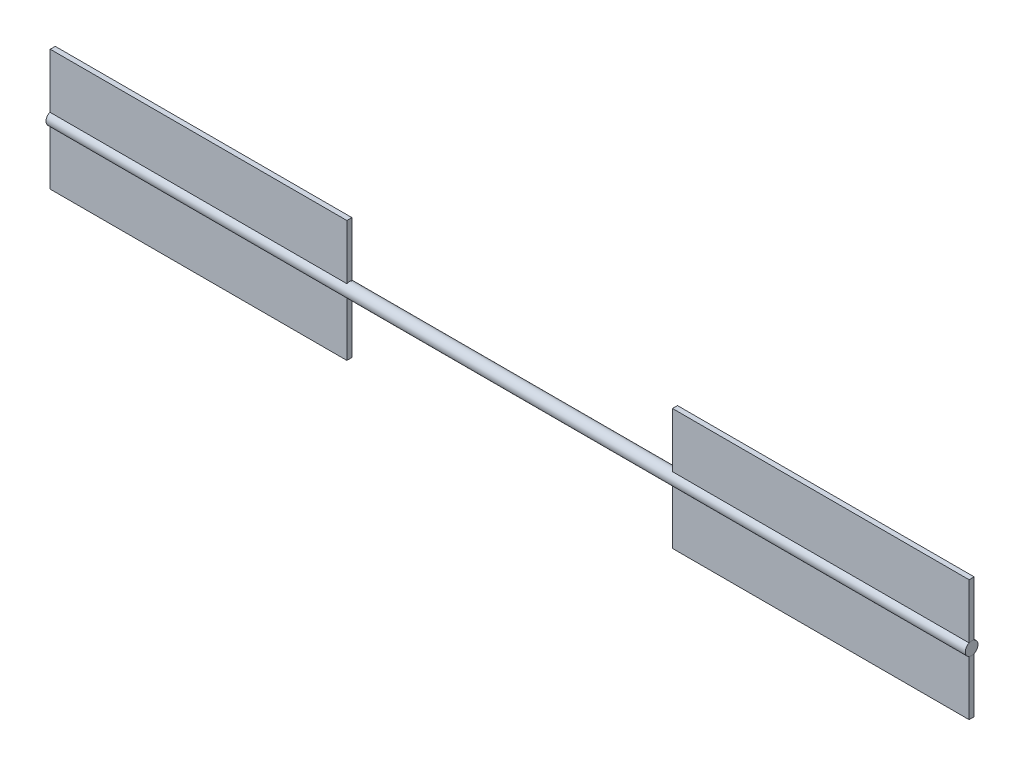
ISO-10303-21;
HEADER;
FILE_DESCRIPTION(('STEP AP214'),'2;1');
FILE_NAME('part.step','',(''),(''),'','','');
FILE_SCHEMA(('AUTOMOTIVE_DESIGN { 1 0 10303 214 1 1 1 1 }'));
ENDSEC;
DATA;
#1=APPLICATION_CONTEXT('core data for automotive mechanical design processes');
#2=APPLICATION_PROTOCOL_DEFINITION('international standard','automotive_design',2000,#1);
#3=PRODUCT_CONTEXT('',#1,'mechanical');
#4=PRODUCT('Part','Part','',(#3));
#5=PRODUCT_RELATED_PRODUCT_CATEGORY('part','',(#4));
#6=PRODUCT_DEFINITION_FORMATION('','',#4);
#7=PRODUCT_DEFINITION_CONTEXT('part definition',#1,'design');
#8=PRODUCT_DEFINITION('design','',#6,#7);
#9=PRODUCT_DEFINITION_SHAPE('','',#8);
#10=(LENGTH_UNIT() NAMED_UNIT(*) SI_UNIT(.MILLI.,.METRE.));
#11=(NAMED_UNIT(*) PLANE_ANGLE_UNIT() SI_UNIT($,.RADIAN.));
#12=(NAMED_UNIT(*) SI_UNIT($,.STERADIAN.) SOLID_ANGLE_UNIT());
#13=UNCERTAINTY_MEASURE_WITH_UNIT(LENGTH_MEASURE(1.E-05),#10,'distance_accuracy_value','');
#14=(GEOMETRIC_REPRESENTATION_CONTEXT(3) GLOBAL_UNCERTAINTY_ASSIGNED_CONTEXT((#13)) GLOBAL_UNIT_ASSIGNED_CONTEXT((#10,
#11,#12)) REPRESENTATION_CONTEXT('',''));
#15=CARTESIAN_POINT('',(0.,0.,0.));
#16=DIRECTION('',(0.,0.,1.));
#17=DIRECTION('',(1.,0.,0.));
#18=AXIS2_PLACEMENT_3D('',#15,#16,#17);
#19=CARTESIAN_POINT('',(-1200.47028357876,0.,197.80000000001));
#20=DIRECTION('',(1.,0.,0.));
#21=DIRECTION('',(0.,0.,-1.));
#22=AXIS2_PLACEMENT_3D('',#19,#20,#21);
#23=CYLINDRICAL_SURFACE('',#22,25.4);
#24=DIRECTION('',(1.,0.,0.));
#25=VECTOR('',#24,1.);
#26=CARTESIAN_POINT('',(-1200.47028357876,-23.3486616318795,207.80000000001));
#27=LINE('',#26,#25);
#28=CARTESIAN_POINT('',(2459.4620213761,-23.3486616318794,207.80000000001));
#29=VERTEX_POINT('',#28);
#30=CARTESIAN_POINT('',(1278.3620213761,-23.3486616318795,207.80000000001));
#31=VERTEX_POINT('',#30);
#32=EDGE_CURVE('E11',#29,#31,#27,.F.);
#33=ORIENTED_EDGE('',*,*,#32,.F.);
#34=CARTESIAN_POINT('',(2459.4620213761,0.,197.80000000001));
#35=DIRECTION('',(1.,0.,0.));
#36=DIRECTION('',(0.,0.,-1.));
#37=AXIS2_PLACEMENT_3D('',#34,#35,#36);
#38=CIRCLE('',#37,25.4);
#39=CARTESIAN_POINT('',(2459.4620213761,-23.3486616318793,187.80000000001));
#40=VERTEX_POINT('',#39);
#41=EDGE_CURVE('E264',#40,#29,#38,.F.);
#42=ORIENTED_EDGE('',*,*,#41,.F.);
#43=DIRECTION('',(1.,0.,0.));
#44=VECTOR('',#43,1.);
#45=CARTESIAN_POINT('',(-1200.47028357876,-23.3486616318794,187.80000000001));
#46=LINE('',#45,#44);
#47=CARTESIAN_POINT('',(1278.3620213761,-23.3486616318794,187.80000000001));
#48=VERTEX_POINT('',#47);
#49=EDGE_CURVE('E267',#40,#48,#46,.F.);
#50=ORIENTED_EDGE('',*,*,#49,.T.);
#51=CARTESIAN_POINT('',(1278.3620213761,0.,197.80000000001));
#52=DIRECTION('',(-1.,0.,0.));
#53=DIRECTION('',(0.,-1.,0.));
#54=AXIS2_PLACEMENT_3D('',#51,#52,#53);
#55=CIRCLE('',#54,25.4);
#56=EDGE_CURVE('E52',#31,#48,#55,.F.);
#57=ORIENTED_EDGE('',*,*,#56,.F.);
#58=EDGE_LOOP('',(#33,#42,#50,#57));
#59=FACE_BOUND('',#58,.T.);
#60=DIRECTION('',(1.,0.,0.));
#61=VECTOR('',#60,1.);
#62=CARTESIAN_POINT('',(-1200.47028357876,23.3486616318794,207.80000000001));
#63=LINE('',#62,#61);
#64=CARTESIAN_POINT('',(1278.3620213761,23.3486616318794,207.80000000001));
#65=VERTEX_POINT('',#64);
#66=CARTESIAN_POINT('',(2459.4620213761,23.3486616318795,207.80000000001));
#67=VERTEX_POINT('',#66);
#68=EDGE_CURVE('E266',#65,#67,#63,.T.);
#69=ORIENTED_EDGE('',*,*,#68,.F.);
#70=CARTESIAN_POINT('',(1278.3620213761,23.3486616318795,187.80000000001));
#71=VERTEX_POINT('',#70);
#72=EDGE_CURVE('E263',#71,#65,#55,.F.);
#73=ORIENTED_EDGE('',*,*,#72,.F.);
#74=DIRECTION('',(1.,0.,0.));
#75=VECTOR('',#74,1.);
#76=CARTESIAN_POINT('',(-1200.47028357876,23.3486616318795,187.80000000001));
#77=LINE('',#76,#75);
#78=CARTESIAN_POINT('',(2459.4620213761,23.3486616318795,187.80000000001));
#79=VERTEX_POINT('',#78);
#80=EDGE_CURVE('E162',#71,#79,#77,.T.);
#81=ORIENTED_EDGE('',*,*,#80,.T.);
#82=EDGE_CURVE('E261',#67,#79,#38,.F.);
#83=ORIENTED_EDGE('',*,*,#82,.F.);
#84=EDGE_LOOP('',(#69,#73,#81,#83));
#85=FACE_BOUND('',#84,.T.);
#86=DIRECTION('',(1.,0.,0.));
#87=VECTOR('',#86,1.);
#88=CARTESIAN_POINT('',(-1200.47028357876,-23.3486616318795,207.80000000001));
#89=LINE('',#88,#87);
#90=CARTESIAN_POINT('',(-17.8955129710086,-23.3486616318795,207.80000000001));
#91=VERTEX_POINT('',#90);
#92=CARTESIAN_POINT('',(-1198.99551297101,-23.3486616318795,207.80000000001));
#93=VERTEX_POINT('',#92);
#94=EDGE_CURVE('E258',#91,#93,#89,.F.);
#95=ORIENTED_EDGE('',*,*,#94,.F.);
#96=CARTESIAN_POINT('',(-17.8955129710088,0.,197.80000000001));
#97=DIRECTION('',(1.,0.,0.));
#98=DIRECTION('',(0.,1.,0.));
#99=AXIS2_PLACEMENT_3D('',#96,#97,#98);
#100=CIRCLE('',#99,25.4);
#101=CARTESIAN_POINT('',(-17.8955129710086,-23.3486616318794,187.80000000001));
#102=VERTEX_POINT('',#101);
#103=EDGE_CURVE('E253',#102,#91,#100,.F.);
#104=ORIENTED_EDGE('',*,*,#103,.F.);
#105=DIRECTION('',(1.,0.,0.));
#106=VECTOR('',#105,1.);
#107=CARTESIAN_POINT('',(-1200.47028357876,-23.3486616318794,187.80000000001));
#108=LINE('',#107,#106);
#109=CARTESIAN_POINT('',(-1198.99551297101,-23.3486616318794,187.80000000001));
#110=VERTEX_POINT('',#109);
#111=EDGE_CURVE('E255',#102,#110,#108,.F.);
#112=ORIENTED_EDGE('',*,*,#111,.T.);
#113=CARTESIAN_POINT('',(-1198.99551297101,0.,197.80000000001));
#114=DIRECTION('',(-1.,0.,0.));
#115=DIRECTION('',(0.,0.,1.));
#116=AXIS2_PLACEMENT_3D('',#113,#114,#115);
#117=CIRCLE('',#116,25.4);
#118=EDGE_CURVE('E249',#93,#110,#117,.F.);
#119=ORIENTED_EDGE('',*,*,#118,.F.);
#120=EDGE_LOOP('',(#95,#104,#112,#119));
#121=FACE_BOUND('',#120,.T.);
#122=DIRECTION('',(1.,0.,0.));
#123=VECTOR('',#122,1.);
#124=CARTESIAN_POINT('',(-1200.47028357876,23.3486616318794,207.80000000001));
#125=LINE('',#124,#123);
#126=CARTESIAN_POINT('',(-1198.99551297101,23.3486616318794,207.80000000001));
#127=VERTEX_POINT('',#126);
#128=CARTESIAN_POINT('',(-17.8955129710086,23.3486616318794,207.80000000001));
#129=VERTEX_POINT('',#128);
#130=EDGE_CURVE('E252',#127,#129,#125,.T.);
#131=ORIENTED_EDGE('',*,*,#130,.F.);
#132=CARTESIAN_POINT('',(-1198.99551297101,23.3486616318795,187.80000000001));
#133=VERTEX_POINT('',#132);
#134=EDGE_CURVE('E246',#133,#127,#117,.F.);
#135=ORIENTED_EDGE('',*,*,#134,.F.);
#136=DIRECTION('',(1.,0.,0.));
#137=VECTOR('',#136,1.);
#138=CARTESIAN_POINT('',(-1200.47028357876,23.3486616318795,187.80000000001));
#139=LINE('',#138,#137);
#140=CARTESIAN_POINT('',(-17.8955129710086,23.3486616318795,187.80000000001));
#141=VERTEX_POINT('',#140);
#142=EDGE_CURVE('E241',#133,#141,#139,.T.);
#143=ORIENTED_EDGE('',*,*,#142,.T.);
#144=EDGE_CURVE('E248',#129,#141,#100,.F.);
#145=ORIENTED_EDGE('',*,*,#144,.F.);
#146=EDGE_LOOP('',(#131,#135,#143,#145));
#147=FACE_BOUND('',#146,.T.);
#148=CARTESIAN_POINT('',(-1200.47028357876,0.,197.80000000001));
#149=DIRECTION('',(1.,0.,0.));
#150=DIRECTION('',(0.,0.,-1.));
#151=AXIS2_PLACEMENT_3D('',#148,#149,#150);
#152=CIRCLE('',#151,25.4);
#153=CARTESIAN_POINT('',(-1200.47028357876,0.,172.40000000001));
#154=VERTEX_POINT('',#153);
#155=EDGE_CURVE('E238',#154,#154,#152,.T.);
#156=ORIENTED_EDGE('',*,*,#155,.T.);
#157=EDGE_LOOP('',(#156));
#158=FACE_BOUND('',#157,.T.);
#159=CARTESIAN_POINT('',(2459.52971642124,0.,197.80000000001));
#160=DIRECTION('',(1.,0.,0.));
#161=DIRECTION('',(0.,0.,-1.));
#162=AXIS2_PLACEMENT_3D('',#159,#160,#161);
#163=CIRCLE('',#162,25.4);
#164=CARTESIAN_POINT('',(2459.52971642124,0.,172.40000000001));
#165=VERTEX_POINT('',#164);
#166=EDGE_CURVE('E198',#165,#165,#163,.T.);
#167=ORIENTED_EDGE('',*,*,#166,.F.);
#168=EDGE_LOOP('',(#167));
#169=FACE_BOUND('',#168,.T.);
#170=ADVANCED_FACE('F45',(#59,#85,#121,#147,#158,#169),#23,.T.);
#171=CARTESIAN_POINT('',(-1200.47028357876,0.,197.80000000001));
#172=DIRECTION('',(1.,0.,0.));
#173=DIRECTION('',(0.,0.,-1.));
#174=AXIS2_PLACEMENT_3D('',#171,#172,#173);
#175=PLANE('',#174);
#176=ORIENTED_EDGE('',*,*,#155,.F.);
#177=EDGE_LOOP('',(#176));
#178=FACE_BOUND('',#177,.T.);
#179=ADVANCED_FACE('F300',(#178),#175,.F.);
#180=CARTESIAN_POINT('',(2459.52971642124,0.,197.80000000001));
#181=DIRECTION('',(1.,0.,0.));
#182=DIRECTION('',(0.,0.,-1.));
#183=AXIS2_PLACEMENT_3D('',#180,#181,#182);
#184=PLANE('',#183);
#185=ORIENTED_EDGE('',*,*,#166,.T.);
#186=EDGE_LOOP('',(#185));
#187=FACE_BOUND('',#186,.T.);
#188=ADVANCED_FACE('F304',(#187),#184,.T.);
#189=CARTESIAN_POINT('',(-17.8955129710086,241.299999999999,207.800000000011));
#190=DIRECTION('',(0.,1.,0.));
#191=DIRECTION('',(0.,0.,1.));
#192=AXIS2_PLACEMENT_3D('',#189,#190,#191);
#193=PLANE('',#192);
#194=DIRECTION('',(0.,0.,-1.));
#195=VECTOR('',#194,1.);
#196=CARTESIAN_POINT('',(-17.8955129710086,241.299999999999,207.800000000011));
#197=LINE('',#196,#195);
#198=CARTESIAN_POINT('',(-17.8955129710086,241.299999999999,207.800000000011));
#199=VERTEX_POINT('',#198);
#200=CARTESIAN_POINT('',(-17.8955129710086,241.299999999999,187.800000000011));
#201=VERTEX_POINT('',#200);
#202=EDGE_CURVE('E212',#199,#201,#197,.T.);
#203=ORIENTED_EDGE('',*,*,#202,.T.);
#204=DIRECTION('',(1.,0.,0.));
#205=VECTOR('',#204,1.);
#206=CARTESIAN_POINT('',(-17.8955129710086,241.299999999999,187.800000000011));
#207=LINE('',#206,#205);
#208=CARTESIAN_POINT('',(-1198.99551297101,241.299999999999,187.800000000011));
#209=VERTEX_POINT('',#208);
#210=EDGE_CURVE('E227',#209,#201,#207,.T.);
#211=ORIENTED_EDGE('',*,*,#210,.F.);
#212=DIRECTION('',(0.,0.,-1.));
#213=VECTOR('',#212,1.);
#214=CARTESIAN_POINT('',(-1198.99551297101,241.299999999999,207.800000000011));
#215=LINE('',#214,#213);
#216=CARTESIAN_POINT('',(-1198.99551297101,241.299999999999,207.800000000011));
#217=VERTEX_POINT('',#216);
#218=EDGE_CURVE('E209',#217,#209,#215,.T.);
#219=ORIENTED_EDGE('',*,*,#218,.F.);
#220=DIRECTION('',(1.,0.,0.));
#221=VECTOR('',#220,1.);
#222=CARTESIAN_POINT('',(-17.8955129710086,241.299999999999,207.800000000011));
#223=LINE('',#222,#221);
#224=EDGE_CURVE('E206',#217,#199,#223,.T.);
#225=ORIENTED_EDGE('',*,*,#224,.T.);
#226=EDGE_LOOP('',(#203,#211,#219,#225));
#227=FACE_BOUND('',#226,.T.);
#228=ADVANCED_FACE('F310',(#227),#193,.T.);
#229=CARTESIAN_POINT('',(0.,-6.93641638287223E-13,207.80000000001));
#230=DIRECTION('',(0.,0.,1.));
#231=DIRECTION('',(0.,-1.,0.));
#232=AXIS2_PLACEMENT_3D('',#229,#230,#231);
#233=PLANE('',#232);
#234=DIRECTION('',(0.,1.,0.));
#235=VECTOR('',#234,1.);
#236=CARTESIAN_POINT('',(-1198.99551297101,-241.300000000001,207.800000000009));
#237=LINE('',#236,#235);
#238=EDGE_CURVE('E216',#127,#217,#237,.T.);
#239=ORIENTED_EDGE('',*,*,#238,.F.);
#240=ORIENTED_EDGE('',*,*,#130,.T.);
#241=DIRECTION('',(0.,-1.,0.));
#242=VECTOR('',#241,1.);
#243=CARTESIAN_POINT('',(-17.8955129710087,-241.300000000001,207.800000000009));
#244=LINE('',#243,#242);
#245=EDGE_CURVE('E224',#199,#129,#244,.T.);
#246=ORIENTED_EDGE('',*,*,#245,.F.);
#247=ORIENTED_EDGE('',*,*,#224,.F.);
#248=EDGE_LOOP('',(#239,#240,#246,#247));
#249=FACE_BOUND('',#248,.T.);
#250=ADVANCED_FACE('F318',(#249),#233,.T.);
#251=CARTESIAN_POINT('',(0.,-6.25973221608167E-13,187.80000000001));
#252=DIRECTION('',(0.,0.,1.));
#253=DIRECTION('',(0.,-1.,0.));
#254=AXIS2_PLACEMENT_3D('',#251,#252,#253);
#255=PLANE('',#254);
#256=ORIENTED_EDGE('',*,*,#142,.F.);
#257=DIRECTION('',(0.,1.,0.));
#258=VECTOR('',#257,1.);
#259=CARTESIAN_POINT('',(-1198.99551297101,-241.300000000001,187.800000000009));
#260=LINE('',#259,#258);
#261=EDGE_CURVE('E230',#133,#209,#260,.T.);
#262=ORIENTED_EDGE('',*,*,#261,.T.);
#263=ORIENTED_EDGE('',*,*,#210,.T.);
#264=DIRECTION('',(0.,-1.,0.));
#265=VECTOR('',#264,1.);
#266=CARTESIAN_POINT('',(-17.8955129710087,-241.300000000001,187.800000000009));
#267=LINE('',#266,#265);
#268=EDGE_CURVE('E165',#201,#141,#267,.T.);
#269=ORIENTED_EDGE('',*,*,#268,.T.);
#270=EDGE_LOOP('',(#256,#262,#263,#269));
#271=FACE_BOUND('',#270,.T.);
#272=ADVANCED_FACE('F314',(#271),#255,.F.);
#273=CARTESIAN_POINT('',(-1198.99551297101,-241.300000000001,207.800000000009));
#274=DIRECTION('',(-1.,0.,0.));
#275=DIRECTION('',(0.,0.,1.));
#276=AXIS2_PLACEMENT_3D('',#273,#274,#275);
#277=PLANE('',#276);
#278=ORIENTED_EDGE('',*,*,#261,.F.);
#279=ORIENTED_EDGE('',*,*,#134,.T.);
#280=ORIENTED_EDGE('',*,*,#238,.T.);
#281=ORIENTED_EDGE('',*,*,#218,.T.);
#282=EDGE_LOOP('',(#278,#279,#280,#281));
#283=FACE_BOUND('',#282,.T.);
#284=ADVANCED_FACE('F317',(#283),#277,.T.);
#285=CARTESIAN_POINT('',(-17.8955129710087,-241.300000000001,207.800000000009));
#286=DIRECTION('',(1.,0.,0.));
#287=DIRECTION('',(0.,1.,0.));
#288=AXIS2_PLACEMENT_3D('',#285,#286,#287);
#289=PLANE('',#288);
#290=ORIENTED_EDGE('',*,*,#245,.T.);
#291=ORIENTED_EDGE('',*,*,#144,.T.);
#292=ORIENTED_EDGE('',*,*,#268,.F.);
#293=ORIENTED_EDGE('',*,*,#202,.F.);
#294=EDGE_LOOP('',(#290,#291,#292,#293));
#295=FACE_BOUND('',#294,.T.);
#296=ADVANCED_FACE('F330',(#295),#289,.T.);
#297=CARTESIAN_POINT('',(-17.8955129710087,-241.300000000001,187.800000000009));
#298=VERTEX_POINT('',#297);
#299=EDGE_CURVE('E236',#102,#298,#267,.T.);
#300=ORIENTED_EDGE('',*,*,#299,.F.);
#301=ORIENTED_EDGE('',*,*,#103,.T.);
#302=CARTESIAN_POINT('',(-17.8955129710087,-241.300000000001,207.800000000009));
#303=VERTEX_POINT('',#302);
#304=EDGE_CURVE('E223',#91,#303,#244,.T.);
#305=ORIENTED_EDGE('',*,*,#304,.T.);
#306=DIRECTION('',(0.,0.,-1.));
#307=VECTOR('',#306,1.);
#308=CARTESIAN_POINT('',(-17.8955129710087,-241.300000000001,207.800000000009));
#309=LINE('',#308,#307);
#310=EDGE_CURVE('E203',#303,#298,#309,.T.);
#311=ORIENTED_EDGE('',*,*,#310,.T.);
#312=EDGE_LOOP('',(#300,#301,#305,#311));
#313=FACE_BOUND('',#312,.T.);
#314=ADVANCED_FACE('F338',(#313),#289,.T.);
#315=CARTESIAN_POINT('',(-1198.99551297101,-241.300000000001,207.800000000009));
#316=VERTEX_POINT('',#315);
#317=EDGE_CURVE('E217',#316,#93,#237,.T.);
#318=ORIENTED_EDGE('',*,*,#317,.T.);
#319=ORIENTED_EDGE('',*,*,#118,.T.);
#320=CARTESIAN_POINT('',(-1198.99551297101,-241.300000000001,187.800000000009));
#321=VERTEX_POINT('',#320);
#322=EDGE_CURVE('E231',#321,#110,#260,.T.);
#323=ORIENTED_EDGE('',*,*,#322,.F.);
#324=DIRECTION('',(0.,0.,-1.));
#325=VECTOR('',#324,1.);
#326=CARTESIAN_POINT('',(-1198.99551297101,-241.300000000001,207.800000000009));
#327=LINE('',#326,#325);
#328=EDGE_CURVE('E207',#316,#321,#327,.T.);
#329=ORIENTED_EDGE('',*,*,#328,.F.);
#330=EDGE_LOOP('',(#318,#319,#323,#329));
#331=FACE_BOUND('',#330,.T.);
#332=ADVANCED_FACE('F332',(#331),#277,.T.);
#333=ORIENTED_EDGE('',*,*,#304,.F.);
#334=ORIENTED_EDGE('',*,*,#94,.T.);
#335=ORIENTED_EDGE('',*,*,#317,.F.);
#336=DIRECTION('',(-1.,0.,0.));
#337=VECTOR('',#336,1.);
#338=CARTESIAN_POINT('',(-17.8955129710087,-241.300000000001,207.800000000009));
#339=LINE('',#338,#337);
#340=EDGE_CURVE('E220',#303,#316,#339,.T.);
#341=ORIENTED_EDGE('',*,*,#340,.F.);
#342=EDGE_LOOP('',(#333,#334,#335,#341));
#343=FACE_BOUND('',#342,.T.);
#344=ADVANCED_FACE('F324',(#343),#233,.T.);
#345=ORIENTED_EDGE('',*,*,#111,.F.);
#346=ORIENTED_EDGE('',*,*,#299,.T.);
#347=DIRECTION('',(-1.,0.,0.));
#348=VECTOR('',#347,1.);
#349=CARTESIAN_POINT('',(-17.8955129710087,-241.300000000001,187.800000000009));
#350=LINE('',#349,#348);
#351=EDGE_CURVE('E233',#298,#321,#350,.T.);
#352=ORIENTED_EDGE('',*,*,#351,.T.);
#353=ORIENTED_EDGE('',*,*,#322,.T.);
#354=EDGE_LOOP('',(#345,#346,#352,#353));
#355=FACE_BOUND('',#354,.T.);
#356=ADVANCED_FACE('F320',(#355),#255,.F.);
#357=CARTESIAN_POINT('',(-17.8955129710087,-241.300000000001,207.800000000009));
#358=DIRECTION('',(0.,-1.,0.));
#359=DIRECTION('',(0.,0.,-1.));
#360=AXIS2_PLACEMENT_3D('',#357,#358,#359);
#361=PLANE('',#360);
#362=ORIENTED_EDGE('',*,*,#328,.T.);
#363=ORIENTED_EDGE('',*,*,#351,.F.);
#364=ORIENTED_EDGE('',*,*,#310,.F.);
#365=ORIENTED_EDGE('',*,*,#340,.T.);
#366=EDGE_LOOP('',(#362,#363,#364,#365));
#367=FACE_BOUND('',#366,.T.);
#368=ADVANCED_FACE('F333',(#367),#361,.T.);
#369=CARTESIAN_POINT('',(1278.3620213761,241.299999999999,207.800000000011));
#370=DIRECTION('',(0.,1.,0.));
#371=DIRECTION('',(0.,0.,1.));
#372=AXIS2_PLACEMENT_3D('',#369,#370,#371);
#373=PLANE('',#372);
#374=DIRECTION('',(0.,0.,-1.));
#375=VECTOR('',#374,1.);
#376=CARTESIAN_POINT('',(2459.4620213761,241.299999999999,207.800000000011));
#377=LINE('',#376,#375);
#378=CARTESIAN_POINT('',(2459.4620213761,241.299999999999,207.800000000011));
#379=VERTEX_POINT('',#378);
#380=CARTESIAN_POINT('',(2459.4620213761,241.299999999999,187.800000000011));
#381=VERTEX_POINT('',#380);
#382=EDGE_CURVE('E175',#379,#381,#377,.T.);
#383=ORIENTED_EDGE('',*,*,#382,.T.);
#384=DIRECTION('',(1.,0.,0.));
#385=VECTOR('',#384,1.);
#386=CARTESIAN_POINT('',(1278.3620213761,241.299999999999,187.800000000011));
#387=LINE('',#386,#385);
#388=CARTESIAN_POINT('',(1278.3620213761,241.299999999999,187.800000000011));
#389=VERTEX_POINT('',#388);
#390=EDGE_CURVE('E160',#389,#381,#387,.T.);
#391=ORIENTED_EDGE('',*,*,#390,.F.);
#392=DIRECTION('',(0.,0.,-1.));
#393=VECTOR('',#392,1.);
#394=CARTESIAN_POINT('',(1278.3620213761,241.299999999999,207.800000000011));
#395=LINE('',#394,#393);
#396=CARTESIAN_POINT('',(1278.3620213761,241.299999999999,207.800000000011));
#397=VERTEX_POINT('',#396);
#398=EDGE_CURVE('E168',#397,#389,#395,.T.);
#399=ORIENTED_EDGE('',*,*,#398,.F.);
#400=DIRECTION('',(1.,0.,0.));
#401=VECTOR('',#400,1.);
#402=CARTESIAN_POINT('',(1278.3620213761,241.299999999999,207.800000000011));
#403=LINE('',#402,#401);
#404=EDGE_CURVE('E188',#397,#379,#403,.T.);
#405=ORIENTED_EDGE('',*,*,#404,.T.);
#406=EDGE_LOOP('',(#383,#391,#399,#405));
#407=FACE_BOUND('',#406,.T.);
#408=ADVANCED_FACE('F178',(#407),#373,.T.);
#409=CARTESIAN_POINT('',(0.,-6.25973221608167E-13,187.80000000001));
#410=DIRECTION('',(0.,0.,1.));
#411=DIRECTION('',(0.,-1.,0.));
#412=AXIS2_PLACEMENT_3D('',#409,#410,#411);
#413=PLANE('',#412);
#414=ORIENTED_EDGE('',*,*,#80,.F.);
#415=DIRECTION('',(0.,1.,0.));
#416=VECTOR('',#415,1.);
#417=CARTESIAN_POINT('',(1278.3620213761,241.299999999999,187.800000000011));
#418=LINE('',#417,#416);
#419=EDGE_CURVE('E156',#71,#389,#418,.T.);
#420=ORIENTED_EDGE('',*,*,#419,.T.);
#421=ORIENTED_EDGE('',*,*,#390,.T.);
#422=DIRECTION('',(0.,-1.,0.));
#423=VECTOR('',#422,1.);
#424=CARTESIAN_POINT('',(2459.4620213761,241.299999999999,187.800000000011));
#425=LINE('',#424,#423);
#426=EDGE_CURVE('E67',#381,#79,#425,.T.);
#427=ORIENTED_EDGE('',*,*,#426,.T.);
#428=EDGE_LOOP('',(#414,#420,#421,#427));
#429=FACE_BOUND('',#428,.T.);
#430=ADVANCED_FACE('F158',(#429),#413,.F.);
#431=CARTESIAN_POINT('',(0.,-6.93641638287224E-13,207.80000000001));
#432=DIRECTION('',(0.,0.,1.));
#433=DIRECTION('',(0.,-1.,0.));
#434=AXIS2_PLACEMENT_3D('',#431,#432,#433);
#435=PLANE('',#434);
#436=DIRECTION('',(0.,1.,0.));
#437=VECTOR('',#436,1.);
#438=CARTESIAN_POINT('',(1278.3620213761,241.299999999999,207.800000000011));
#439=LINE('',#438,#437);
#440=EDGE_CURVE('E171',#65,#397,#439,.T.);
#441=ORIENTED_EDGE('',*,*,#440,.F.);
#442=ORIENTED_EDGE('',*,*,#68,.T.);
#443=DIRECTION('',(0.,-1.,0.));
#444=VECTOR('',#443,1.);
#445=CARTESIAN_POINT('',(2459.4620213761,241.299999999999,207.800000000011));
#446=LINE('',#445,#444);
#447=EDGE_CURVE('E191',#379,#67,#446,.T.);
#448=ORIENTED_EDGE('',*,*,#447,.F.);
#449=ORIENTED_EDGE('',*,*,#404,.F.);
#450=EDGE_LOOP('',(#441,#442,#448,#449));
#451=FACE_BOUND('',#450,.T.);
#452=ADVANCED_FACE('F297',(#451),#435,.T.);
#453=CARTESIAN_POINT('',(2459.4620213761,241.299999999999,207.800000000011));
#454=DIRECTION('',(1.,0.,0.));
#455=DIRECTION('',(0.,0.,-1.));
#456=AXIS2_PLACEMENT_3D('',#453,#454,#455);
#457=PLANE('',#456);
#458=ORIENTED_EDGE('',*,*,#447,.T.);
#459=ORIENTED_EDGE('',*,*,#82,.T.);
#460=ORIENTED_EDGE('',*,*,#426,.F.);
#461=ORIENTED_EDGE('',*,*,#382,.F.);
#462=EDGE_LOOP('',(#458,#459,#460,#461));
#463=FACE_BOUND('',#462,.T.);
#464=ADVANCED_FACE('F343',(#463),#457,.T.);
#465=CARTESIAN_POINT('',(1278.3620213761,241.299999999999,207.800000000011));
#466=DIRECTION('',(-1.,0.,0.));
#467=DIRECTION('',(0.,-1.,0.));
#468=AXIS2_PLACEMENT_3D('',#465,#466,#467);
#469=PLANE('',#468);
#470=ORIENTED_EDGE('',*,*,#419,.F.);
#471=ORIENTED_EDGE('',*,*,#72,.T.);
#472=ORIENTED_EDGE('',*,*,#440,.T.);
#473=ORIENTED_EDGE('',*,*,#398,.T.);
#474=EDGE_LOOP('',(#470,#471,#472,#473));
#475=FACE_BOUND('',#474,.T.);
#476=ADVANCED_FACE('F169',(#475),#469,.T.);
#477=CARTESIAN_POINT('',(2459.4620213761,-241.300000000001,187.800000000009));
#478=VERTEX_POINT('',#477);
#479=EDGE_CURVE('E179',#40,#478,#425,.T.);
#480=ORIENTED_EDGE('',*,*,#479,.F.);
#481=ORIENTED_EDGE('',*,*,#41,.T.);
#482=CARTESIAN_POINT('',(2459.4620213761,-241.300000000001,207.800000000009));
#483=VERTEX_POINT('',#482);
#484=EDGE_CURVE('E190',#29,#483,#446,.T.);
#485=ORIENTED_EDGE('',*,*,#484,.T.);
#486=DIRECTION('',(0.,0.,-1.));
#487=VECTOR('',#486,1.);
#488=CARTESIAN_POINT('',(2459.4620213761,-241.300000000001,207.800000000009));
#489=LINE('',#488,#487);
#490=EDGE_CURVE('E199',#483,#478,#489,.T.);
#491=ORIENTED_EDGE('',*,*,#490,.T.);
#492=EDGE_LOOP('',(#480,#481,#485,#491));
#493=FACE_BOUND('',#492,.T.);
#494=ADVANCED_FACE('F284',(#493),#457,.T.);
#495=ORIENTED_EDGE('',*,*,#484,.F.);
#496=ORIENTED_EDGE('',*,*,#32,.T.);
#497=CARTESIAN_POINT('',(1278.3620213761,-241.300000000001,207.800000000009));
#498=VERTEX_POINT('',#497);
#499=EDGE_CURVE('E185',#498,#31,#439,.T.);
#500=ORIENTED_EDGE('',*,*,#499,.F.);
#501=DIRECTION('',(-1.,0.,0.));
#502=VECTOR('',#501,1.);
#503=CARTESIAN_POINT('',(1278.3620213761,-241.300000000001,207.800000000009));
#504=LINE('',#503,#502);
#505=EDGE_CURVE('E176',#483,#498,#504,.T.);
#506=ORIENTED_EDGE('',*,*,#505,.F.);
#507=EDGE_LOOP('',(#495,#496,#500,#506));
#508=FACE_BOUND('',#507,.T.);
#509=ADVANCED_FACE('F281',(#508),#435,.T.);
#510=ORIENTED_EDGE('',*,*,#49,.F.);
#511=ORIENTED_EDGE('',*,*,#479,.T.);
#512=DIRECTION('',(-1.,0.,0.));
#513=VECTOR('',#512,1.);
#514=CARTESIAN_POINT('',(1278.3620213761,-241.300000000001,187.800000000009));
#515=LINE('',#514,#513);
#516=CARTESIAN_POINT('',(1278.3620213761,-241.300000000001,187.800000000009));
#517=VERTEX_POINT('',#516);
#518=EDGE_CURVE('E183',#478,#517,#515,.T.);
#519=ORIENTED_EDGE('',*,*,#518,.T.);
#520=EDGE_CURVE('E59',#517,#48,#418,.T.);
#521=ORIENTED_EDGE('',*,*,#520,.T.);
#522=EDGE_LOOP('',(#510,#511,#519,#521));
#523=FACE_BOUND('',#522,.T.);
#524=ADVANCED_FACE('F288',(#523),#413,.F.);
#525=ORIENTED_EDGE('',*,*,#499,.T.);
#526=ORIENTED_EDGE('',*,*,#56,.T.);
#527=ORIENTED_EDGE('',*,*,#520,.F.);
#528=DIRECTION('',(0.,0.,-1.));
#529=VECTOR('',#528,1.);
#530=CARTESIAN_POINT('',(1278.3620213761,-241.300000000001,207.800000000009));
#531=LINE('',#530,#529);
#532=EDGE_CURVE('E196',#498,#517,#531,.T.);
#533=ORIENTED_EDGE('',*,*,#532,.F.);
#534=EDGE_LOOP('',(#525,#526,#527,#533));
#535=FACE_BOUND('',#534,.T.);
#536=ADVANCED_FACE('F276',(#535),#469,.T.);
#537=CARTESIAN_POINT('',(1278.3620213761,-241.300000000001,207.800000000009));
#538=DIRECTION('',(0.,-1.,0.));
#539=DIRECTION('',(0.,0.,-1.));
#540=AXIS2_PLACEMENT_3D('',#537,#538,#539);
#541=PLANE('',#540);
#542=ORIENTED_EDGE('',*,*,#532,.T.);
#543=ORIENTED_EDGE('',*,*,#518,.F.);
#544=ORIENTED_EDGE('',*,*,#490,.F.);
#545=ORIENTED_EDGE('',*,*,#505,.T.);
#546=EDGE_LOOP('',(#542,#543,#544,#545));
#547=FACE_BOUND('',#546,.T.);
#548=ADVANCED_FACE('F287',(#547),#541,.T.);
#549=CLOSED_SHELL('',(#170,#179,#188,#228,#250,#272,#284,#296,#314,#332,#344,#356,#368,#408,
#430,#452,#464,#476,#494,#509,#524,#536,#548));
#550=MANIFOLD_SOLID_BREP('B2',#549);
#551=ADVANCED_BREP_SHAPE_REPRESENTATION('',(#18,#550),#14);
#552=SHAPE_DEFINITION_REPRESENTATION(#9,#551);
ENDSEC;
END-ISO-10303-21;
